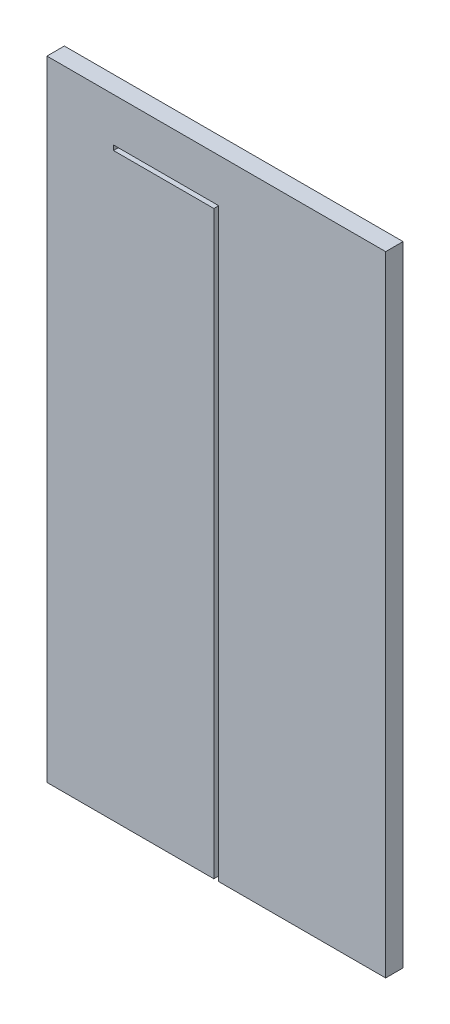
ISO-10303-21;
HEADER;
FILE_DESCRIPTION(('STEP AP214'),'2;1');
FILE_NAME('part.step','',(''),(''),'','','');
FILE_SCHEMA(('AUTOMOTIVE_DESIGN { 1 0 10303 214 1 1 1 1 }'));
ENDSEC;
DATA;
#1=APPLICATION_CONTEXT('core data for automotive mechanical design processes');
#2=APPLICATION_PROTOCOL_DEFINITION('international standard','automotive_design',2000,#1);
#3=PRODUCT_CONTEXT('',#1,'mechanical');
#4=PRODUCT('Part','Part','',(#3));
#5=PRODUCT_RELATED_PRODUCT_CATEGORY('part','',(#4));
#6=PRODUCT_DEFINITION_FORMATION('','',#4);
#7=PRODUCT_DEFINITION_CONTEXT('part definition',#1,'design');
#8=PRODUCT_DEFINITION('design','',#6,#7);
#9=PRODUCT_DEFINITION_SHAPE('','',#8);
#10=(LENGTH_UNIT() NAMED_UNIT(*) SI_UNIT(.MILLI.,.METRE.));
#11=(NAMED_UNIT(*) PLANE_ANGLE_UNIT() SI_UNIT($,.RADIAN.));
#12=(NAMED_UNIT(*) SI_UNIT($,.STERADIAN.) SOLID_ANGLE_UNIT());
#13=UNCERTAINTY_MEASURE_WITH_UNIT(LENGTH_MEASURE(1.E-05),#10,'distance_accuracy_value','');
#14=(GEOMETRIC_REPRESENTATION_CONTEXT(3) GLOBAL_UNCERTAINTY_ASSIGNED_CONTEXT((#13)) GLOBAL_UNIT_ASSIGNED_CONTEXT((#10,
#11,#12)) REPRESENTATION_CONTEXT('',''));
#15=CARTESIAN_POINT('',(0.,0.,0.));
#16=DIRECTION('',(0.,0.,1.));
#17=DIRECTION('',(1.,0.,0.));
#18=AXIS2_PLACEMENT_3D('',#15,#16,#17);
#19=CARTESIAN_POINT('',(0.,0.,18.));
#20=DIRECTION('',(0.,1.,0.));
#21=DIRECTION('',(0.,0.,1.));
#22=AXIS2_PLACEMENT_3D('',#19,#20,#21);
#23=PLANE('',#22);
#24=DIRECTION('',(0.,0.,1.));
#25=VECTOR('',#24,1.);
#26=CARTESIAN_POINT('',(172.5,0.,8.));
#27=LINE('',#26,#25);
#28=CARTESIAN_POINT('',(172.5,0.,8.));
#29=VERTEX_POINT('',#28);
#30=CARTESIAN_POINT('',(172.5,0.,18.));
#31=VERTEX_POINT('',#30);
#32=EDGE_CURVE('E310',#29,#31,#27,.T.);
#33=ORIENTED_EDGE('',*,*,#32,.T.);
#34=DIRECTION('',(1.,0.,0.));
#35=VECTOR('',#34,1.);
#36=CARTESIAN_POINT('',(0.,0.,18.));
#37=LINE('',#36,#35);
#38=CARTESIAN_POINT('',(0.,0.,18.));
#39=VERTEX_POINT('',#38);
#40=EDGE_CURVE('E87',#39,#31,#37,.T.);
#41=ORIENTED_EDGE('',*,*,#40,.F.);
#42=DIRECTION('',(0.,0.,-1.));
#43=VECTOR('',#42,1.);
#44=CARTESIAN_POINT('',(0.,0.,18.));
#45=LINE('',#44,#43);
#46=CARTESIAN_POINT('',(0.,0.,0.));
#47=VERTEX_POINT('',#46);
#48=EDGE_CURVE('E11',#39,#47,#45,.T.);
#49=ORIENTED_EDGE('',*,*,#48,.T.);
#50=DIRECTION('',(1.,0.,0.));
#51=VECTOR('',#50,1.);
#52=CARTESIAN_POINT('',(0.,0.,0.));
#53=LINE('',#52,#51);
#54=CARTESIAN_POINT('',(350.,0.,0.));
#55=VERTEX_POINT('',#54);
#56=EDGE_CURVE('E271',#47,#55,#53,.T.);
#57=ORIENTED_EDGE('',*,*,#56,.T.);
#58=DIRECTION('',(0.,0.,-1.));
#59=VECTOR('',#58,1.);
#60=CARTESIAN_POINT('',(350.,0.,18.));
#61=LINE('',#60,#59);
#62=CARTESIAN_POINT('',(350.,0.,18.));
#63=VERTEX_POINT('',#62);
#64=EDGE_CURVE('E43',#63,#55,#61,.T.);
#65=ORIENTED_EDGE('',*,*,#64,.F.);
#66=CARTESIAN_POINT('',(177.5,0.,18.));
#67=VERTEX_POINT('',#66);
#68=EDGE_CURVE('E262',#67,#63,#37,.T.);
#69=ORIENTED_EDGE('',*,*,#68,.F.);
#70=DIRECTION('',(0.,0.,-1.));
#71=VECTOR('',#70,1.);
#72=CARTESIAN_POINT('',(177.5,0.,8.));
#73=LINE('',#72,#71);
#74=CARTESIAN_POINT('',(177.5,0.,8.));
#75=VERTEX_POINT('',#74);
#76=EDGE_CURVE('E50',#67,#75,#73,.T.);
#77=ORIENTED_EDGE('',*,*,#76,.T.);
#78=DIRECTION('',(1.,0.,0.));
#79=VECTOR('',#78,1.);
#80=CARTESIAN_POINT('',(190.,0.,8.));
#81=LINE('',#80,#79);
#82=CARTESIAN_POINT('',(190.,0.,8.));
#83=VERTEX_POINT('',#82);
#84=EDGE_CURVE('E336',#75,#83,#81,.T.);
#85=ORIENTED_EDGE('',*,*,#84,.T.);
#86=DIRECTION('',(0.,0.,-1.));
#87=VECTOR('',#86,1.);
#88=CARTESIAN_POINT('',(190.,0.,3.));
#89=LINE('',#88,#87);
#90=CARTESIAN_POINT('',(190.,0.,3.));
#91=VERTEX_POINT('',#90);
#92=EDGE_CURVE('E272',#83,#91,#89,.T.);
#93=ORIENTED_EDGE('',*,*,#92,.T.);
#94=DIRECTION('',(-1.,0.,0.));
#95=VECTOR('',#94,1.);
#96=CARTESIAN_POINT('',(190.,0.,3.));
#97=LINE('',#96,#95);
#98=CARTESIAN_POINT('',(160.,0.,3.));
#99=VERTEX_POINT('',#98);
#100=EDGE_CURVE('E165',#91,#99,#97,.T.);
#101=ORIENTED_EDGE('',*,*,#100,.T.);
#102=DIRECTION('',(0.,0.,1.));
#103=VECTOR('',#102,1.);
#104=CARTESIAN_POINT('',(160.,0.,3.));
#105=LINE('',#104,#103);
#106=CARTESIAN_POINT('',(160.,0.,8.));
#107=VERTEX_POINT('',#106);
#108=EDGE_CURVE('E198',#99,#107,#105,.T.);
#109=ORIENTED_EDGE('',*,*,#108,.T.);
#110=DIRECTION('',(1.,0.,0.));
#111=VECTOR('',#110,1.);
#112=CARTESIAN_POINT('',(160.,0.,8.));
#113=LINE('',#112,#111);
#114=EDGE_CURVE('E312',#107,#29,#113,.T.);
#115=ORIENTED_EDGE('',*,*,#114,.T.);
#116=EDGE_LOOP('',(#33,#41,#49,#57,#65,#69,#77,#85,#93,#101,#109,#115));
#117=FACE_BOUND('',#116,.T.);
#118=ADVANCED_FACE('F35',(#117),#23,.F.);
#119=CARTESIAN_POINT('',(0.,0.,18.));
#120=DIRECTION('',(0.,0.,-1.));
#121=DIRECTION('',(-1.,0.,0.));
#122=AXIS2_PLACEMENT_3D('',#119,#120,#121);
#123=PLANE('',#122);
#124=DIRECTION('',(0.,1.,0.));
#125=VECTOR('',#124,1.);
#126=CARTESIAN_POINT('',(172.5,-6.02357194163659,18.));
#127=LINE('',#126,#125);
#128=CARTESIAN_POINT('',(172.5,599.857194163659,18.));
#129=VERTEX_POINT('',#128);
#130=EDGE_CURVE('E222',#31,#129,#127,.T.);
#131=ORIENTED_EDGE('',*,*,#130,.T.);
#132=DIRECTION('',(-1.,0.,0.));
#133=VECTOR('',#132,1.);
#134=CARTESIAN_POINT('',(191.6,599.857194163659,18.));
#135=LINE('',#134,#133);
#136=CARTESIAN_POINT('',(68.7877037308197,599.857194163659,18.));
#137=VERTEX_POINT('',#136);
#138=EDGE_CURVE('E249',#129,#137,#135,.T.);
#139=ORIENTED_EDGE('',*,*,#138,.T.);
#140=DIRECTION('',(0.,-1.,0.));
#141=VECTOR('',#140,1.);
#142=CARTESIAN_POINT('',(68.7877037308197,599.857194163659,18.));
#143=LINE('',#142,#141);
#144=CARTESIAN_POINT('',(68.7877037308197,604.857194163659,18.));
#145=VERTEX_POINT('',#144);
#146=EDGE_CURVE('E234',#145,#137,#143,.T.);
#147=ORIENTED_EDGE('',*,*,#146,.F.);
#148=DIRECTION('',(-1.,0.,0.));
#149=VECTOR('',#148,1.);
#150=CARTESIAN_POINT('',(191.6,604.857194163659,18.));
#151=LINE('',#150,#149);
#152=CARTESIAN_POINT('',(177.5,604.857194163659,18.));
#153=VERTEX_POINT('',#152);
#154=EDGE_CURVE('E252',#153,#145,#151,.T.);
#155=ORIENTED_EDGE('',*,*,#154,.F.);
#156=DIRECTION('',(0.,1.,0.));
#157=VECTOR('',#156,1.);
#158=CARTESIAN_POINT('',(177.5,-6.02357194163659,18.));
#159=LINE('',#158,#157);
#160=EDGE_CURVE('E220',#67,#153,#159,.T.);
#161=ORIENTED_EDGE('',*,*,#160,.F.);
#162=ORIENTED_EDGE('',*,*,#68,.T.);
#163=DIRECTION('',(0.,1.,0.));
#164=VECTOR('',#163,1.);
#165=CARTESIAN_POINT('',(350.,0.,18.));
#166=LINE('',#165,#164);
#167=CARTESIAN_POINT('',(350.,650.,18.));
#168=VERTEX_POINT('',#167);
#169=EDGE_CURVE('E264',#63,#168,#166,.T.);
#170=ORIENTED_EDGE('',*,*,#169,.T.);
#171=DIRECTION('',(-1.,0.,0.));
#172=VECTOR('',#171,1.);
#173=CARTESIAN_POINT('',(0.,650.,18.));
#174=LINE('',#173,#172);
#175=CARTESIAN_POINT('',(0.,650.,18.));
#176=VERTEX_POINT('',#175);
#177=EDGE_CURVE('E59',#168,#176,#174,.T.);
#178=ORIENTED_EDGE('',*,*,#177,.T.);
#179=DIRECTION('',(0.,-1.,0.));
#180=VECTOR('',#179,1.);
#181=CARTESIAN_POINT('',(0.,0.,18.));
#182=LINE('',#181,#180);
#183=EDGE_CURVE('E260',#176,#39,#182,.T.);
#184=ORIENTED_EDGE('',*,*,#183,.T.);
#185=ORIENTED_EDGE('',*,*,#40,.T.);
#186=EDGE_LOOP('',(#131,#139,#147,#155,#161,#162,#170,#178,#184,#185));
#187=FACE_BOUND('',#186,.T.);
#188=ADVANCED_FACE('F304',(#187),#123,.F.);
#189=CARTESIAN_POINT('',(0.,0.,18.));
#190=DIRECTION('',(1.,0.,0.));
#191=DIRECTION('',(0.,0.,-1.));
#192=AXIS2_PLACEMENT_3D('',#189,#190,#191);
#193=PLANE('',#192);
#194=DIRECTION('',(0.,-1.,0.));
#195=VECTOR('',#194,1.);
#196=CARTESIAN_POINT('',(0.,0.,0.));
#197=LINE('',#196,#195);
#198=CARTESIAN_POINT('',(0.,650.,0.));
#199=VERTEX_POINT('',#198);
#200=EDGE_CURVE('E268',#199,#47,#197,.T.);
#201=ORIENTED_EDGE('',*,*,#200,.T.);
#202=ORIENTED_EDGE('',*,*,#48,.F.);
#203=ORIENTED_EDGE('',*,*,#183,.F.);
#204=DIRECTION('',(0.,0.,-1.));
#205=VECTOR('',#204,1.);
#206=CARTESIAN_POINT('',(0.,650.,18.));
#207=LINE('',#206,#205);
#208=EDGE_CURVE('E267',#176,#199,#207,.T.);
#209=ORIENTED_EDGE('',*,*,#208,.T.);
#210=EDGE_LOOP('',(#201,#202,#203,#209));
#211=FACE_BOUND('',#210,.T.);
#212=ADVANCED_FACE('F37',(#211),#193,.F.);
#213=CARTESIAN_POINT('',(350.,0.,18.));
#214=DIRECTION('',(-1.,0.,0.));
#215=DIRECTION('',(0.,0.,1.));
#216=AXIS2_PLACEMENT_3D('',#213,#214,#215);
#217=PLANE('',#216);
#218=DIRECTION('',(0.,1.,0.));
#219=VECTOR('',#218,1.);
#220=CARTESIAN_POINT('',(350.,0.,0.));
#221=LINE('',#220,#219);
#222=CARTESIAN_POINT('',(350.,650.,0.));
#223=VERTEX_POINT('',#222);
#224=EDGE_CURVE('E274',#55,#223,#221,.T.);
#225=ORIENTED_EDGE('',*,*,#224,.T.);
#226=DIRECTION('',(0.,0.,-1.));
#227=VECTOR('',#226,1.);
#228=CARTESIAN_POINT('',(350.,650.,18.));
#229=LINE('',#228,#227);
#230=EDGE_CURVE('E278',#168,#223,#229,.T.);
#231=ORIENTED_EDGE('',*,*,#230,.F.);
#232=ORIENTED_EDGE('',*,*,#169,.F.);
#233=ORIENTED_EDGE('',*,*,#64,.T.);
#234=EDGE_LOOP('',(#225,#231,#232,#233));
#235=FACE_BOUND('',#234,.T.);
#236=ADVANCED_FACE('F284',(#235),#217,.F.);
#237=CARTESIAN_POINT('',(0.,650.,18.));
#238=DIRECTION('',(0.,-1.,0.));
#239=DIRECTION('',(0.,0.,-1.));
#240=AXIS2_PLACEMENT_3D('',#237,#238,#239);
#241=PLANE('',#240);
#242=DIRECTION('',(-1.,0.,0.));
#243=VECTOR('',#242,1.);
#244=CARTESIAN_POINT('',(0.,650.,0.));
#245=LINE('',#244,#243);
#246=EDGE_CURVE('E80',#223,#199,#245,.T.);
#247=ORIENTED_EDGE('',*,*,#246,.T.);
#248=ORIENTED_EDGE('',*,*,#208,.F.);
#249=ORIENTED_EDGE('',*,*,#177,.F.);
#250=ORIENTED_EDGE('',*,*,#230,.T.);
#251=EDGE_LOOP('',(#247,#248,#249,#250));
#252=FACE_BOUND('',#251,.T.);
#253=ADVANCED_FACE('F293',(#252),#241,.F.);
#254=CARTESIAN_POINT('',(0.,0.,0.));
#255=DIRECTION('',(0.,0.,-1.));
#256=DIRECTION('',(-1.,0.,0.));
#257=AXIS2_PLACEMENT_3D('',#254,#255,#256);
#258=PLANE('',#257);
#259=ORIENTED_EDGE('',*,*,#200,.F.);
#260=ORIENTED_EDGE('',*,*,#246,.F.);
#261=ORIENTED_EDGE('',*,*,#224,.F.);
#262=ORIENTED_EDGE('',*,*,#56,.F.);
#263=EDGE_LOOP('',(#259,#260,#261,#262));
#264=FACE_BOUND('',#263,.T.);
#265=ADVANCED_FACE('F289',(#264),#258,.T.);
#266=CARTESIAN_POINT('',(68.7877037308197,427.357194163659,0.));
#267=DIRECTION('',(1.,0.,0.));
#268=DIRECTION('',(0.,0.,-1.));
#269=AXIS2_PLACEMENT_3D('',#266,#267,#268);
#270=PLANE('',#269);
#271=DIRECTION('',(0.,-1.,0.));
#272=VECTOR('',#271,1.);
#273=CARTESIAN_POINT('',(68.7877037308197,587.357194163659,8.));
#274=LINE('',#273,#272);
#275=CARTESIAN_POINT('',(68.7877037308197,599.857194163659,8.));
#276=VERTEX_POINT('',#275);
#277=CARTESIAN_POINT('',(68.7877037308197,587.357194163659,8.));
#278=VERTEX_POINT('',#277);
#279=EDGE_CURVE('E230',#276,#278,#274,.T.);
#280=ORIENTED_EDGE('',*,*,#279,.T.);
#281=DIRECTION('',(0.,0.,-1.));
#282=VECTOR('',#281,1.);
#283=CARTESIAN_POINT('',(68.7877037308197,587.357194163659,3.));
#284=LINE('',#283,#282);
#285=CARTESIAN_POINT('',(68.7877037308197,587.357194163659,3.));
#286=VERTEX_POINT('',#285);
#287=EDGE_CURVE('E228',#278,#286,#284,.T.);
#288=ORIENTED_EDGE('',*,*,#287,.T.);
#289=DIRECTION('',(0.,1.,0.));
#290=VECTOR('',#289,1.);
#291=CARTESIAN_POINT('',(68.7877037308197,617.357194163659,3.));
#292=LINE('',#291,#290);
#293=CARTESIAN_POINT('',(68.7877037308197,617.357194163659,3.));
#294=VERTEX_POINT('',#293);
#295=EDGE_CURVE('E241',#286,#294,#292,.T.);
#296=ORIENTED_EDGE('',*,*,#295,.T.);
#297=DIRECTION('',(0.,0.,1.));
#298=VECTOR('',#297,1.);
#299=CARTESIAN_POINT('',(68.7877037308197,617.357194163659,3.));
#300=LINE('',#299,#298);
#301=CARTESIAN_POINT('',(68.7877037308197,617.357194163659,8.));
#302=VERTEX_POINT('',#301);
#303=EDGE_CURVE('E191',#294,#302,#300,.T.);
#304=ORIENTED_EDGE('',*,*,#303,.T.);
#305=DIRECTION('',(0.,-1.,0.));
#306=VECTOR('',#305,1.);
#307=CARTESIAN_POINT('',(68.7877037308197,617.357194163659,8.));
#308=LINE('',#307,#306);
#309=CARTESIAN_POINT('',(68.7877037308197,604.857194163659,8.));
#310=VERTEX_POINT('',#309);
#311=EDGE_CURVE('E238',#302,#310,#308,.T.);
#312=ORIENTED_EDGE('',*,*,#311,.T.);
#313=DIRECTION('',(0.,0.,1.));
#314=VECTOR('',#313,1.);
#315=CARTESIAN_POINT('',(68.7877037308197,604.857194163659,8.));
#316=LINE('',#315,#314);
#317=EDGE_CURVE('E236',#310,#145,#316,.T.);
#318=ORIENTED_EDGE('',*,*,#317,.T.);
#319=ORIENTED_EDGE('',*,*,#146,.T.);
#320=DIRECTION('',(0.,0.,-1.));
#321=VECTOR('',#320,1.);
#322=CARTESIAN_POINT('',(68.7877037308197,599.857194163659,8.));
#323=LINE('',#322,#321);
#324=EDGE_CURVE('E232',#137,#276,#323,.T.);
#325=ORIENTED_EDGE('',*,*,#324,.T.);
#326=EDGE_LOOP('',(#280,#288,#296,#304,#312,#318,#319,#325));
#327=FACE_BOUND('',#326,.T.);
#328=ADVANCED_FACE('F300',(#327),#270,.T.);
#329=CARTESIAN_POINT('',(191.6,617.357194163659,3.));
#330=DIRECTION('',(0.,0.,1.));
#331=DIRECTION('',(1.,0.,0.));
#332=AXIS2_PLACEMENT_3D('',#329,#330,#331);
#333=PLANE('',#332);
#334=DIRECTION('',(-0.707106781186548,-0.707106781186548,0.));
#335=VECTOR('',#334,1.);
#336=CARTESIAN_POINT('',(-121.690383052648,305.666811111011,3.));
#337=LINE('',#336,#335);
#338=CARTESIAN_POINT('',(190.,617.357194163659,3.));
#339=VERTEX_POINT('',#338);
#340=CARTESIAN_POINT('',(160.,587.357194163659,3.));
#341=VERTEX_POINT('',#340);
#342=EDGE_CURVE('E163',#339,#341,#337,.T.);
#343=ORIENTED_EDGE('',*,*,#342,.F.);
#344=DIRECTION('',(-1.,0.,0.));
#345=VECTOR('',#344,1.);
#346=CARTESIAN_POINT('',(191.6,617.357194163659,3.));
#347=LINE('',#346,#345);
#348=EDGE_CURVE('E178',#339,#294,#347,.T.);
#349=ORIENTED_EDGE('',*,*,#348,.T.);
#350=ORIENTED_EDGE('',*,*,#295,.F.);
#351=DIRECTION('',(-1.,0.,0.));
#352=VECTOR('',#351,1.);
#353=CARTESIAN_POINT('',(191.6,587.357194163659,3.));
#354=LINE('',#353,#352);
#355=EDGE_CURVE('E180',#341,#286,#354,.T.);
#356=ORIENTED_EDGE('',*,*,#355,.F.);
#357=EDGE_LOOP('',(#343,#349,#350,#356));
#358=FACE_BOUND('',#357,.T.);
#359=ADVANCED_FACE('F176',(#358),#333,.T.);
#360=CARTESIAN_POINT('',(191.6,617.357194163659,3.));
#361=DIRECTION('',(0.,-1.,0.));
#362=DIRECTION('',(0.,0.,-1.));
#363=AXIS2_PLACEMENT_3D('',#360,#361,#362);
#364=PLANE('',#363);
#365=DIRECTION('',(0.,0.,-1.));
#366=VECTOR('',#365,1.);
#367=CARTESIAN_POINT('',(190.,617.357194163659,3.));
#368=LINE('',#367,#366);
#369=CARTESIAN_POINT('',(190.,617.357194163659,8.));
#370=VERTEX_POINT('',#369);
#371=EDGE_CURVE('E189',#370,#339,#368,.T.);
#372=ORIENTED_EDGE('',*,*,#371,.F.);
#373=DIRECTION('',(-1.,0.,0.));
#374=VECTOR('',#373,1.);
#375=CARTESIAN_POINT('',(191.6,617.357194163659,8.));
#376=LINE('',#375,#374);
#377=EDGE_CURVE('E192',#370,#302,#376,.T.);
#378=ORIENTED_EDGE('',*,*,#377,.T.);
#379=ORIENTED_EDGE('',*,*,#303,.F.);
#380=ORIENTED_EDGE('',*,*,#348,.F.);
#381=EDGE_LOOP('',(#372,#378,#379,#380));
#382=FACE_BOUND('',#381,.T.);
#383=ADVANCED_FACE('F187',(#382),#364,.T.);
#384=CARTESIAN_POINT('',(191.6,617.357194163659,8.));
#385=DIRECTION('',(0.,0.,-1.));
#386=DIRECTION('',(-1.,0.,0.));
#387=AXIS2_PLACEMENT_3D('',#384,#385,#386);
#388=PLANE('',#387);
#389=DIRECTION('',(0.707106781186548,0.707106781186548,0.));
#390=VECTOR('',#389,1.);
#391=CARTESIAN_POINT('',(-121.690383052648,305.666811111011,8.));
#392=LINE('',#391,#390);
#393=CARTESIAN_POINT('',(177.5,604.857194163659,8.));
#394=VERTEX_POINT('',#393);
#395=EDGE_CURVE('E196',#394,#370,#392,.T.);
#396=ORIENTED_EDGE('',*,*,#395,.F.);
#397=DIRECTION('',(-1.,0.,0.));
#398=VECTOR('',#397,1.);
#399=CARTESIAN_POINT('',(191.6,604.857194163659,8.));
#400=LINE('',#399,#398);
#401=EDGE_CURVE('E255',#394,#310,#400,.T.);
#402=ORIENTED_EDGE('',*,*,#401,.T.);
#403=ORIENTED_EDGE('',*,*,#311,.F.);
#404=ORIENTED_EDGE('',*,*,#377,.F.);
#405=EDGE_LOOP('',(#396,#402,#403,#404));
#406=FACE_BOUND('',#405,.T.);
#407=ADVANCED_FACE('F344',(#406),#388,.T.);
#408=CARTESIAN_POINT('',(191.6,604.857194163659,8.));
#409=DIRECTION('',(0.,-1.,0.));
#410=DIRECTION('',(0.,0.,-1.));
#411=AXIS2_PLACEMENT_3D('',#408,#409,#410);
#412=PLANE('',#411);
#413=DIRECTION('',(0.,0.,-1.));
#414=VECTOR('',#413,1.);
#415=CARTESIAN_POINT('',(177.5,604.857194163659,8.));
#416=LINE('',#415,#414);
#417=EDGE_CURVE('E201',#153,#394,#416,.T.);
#418=ORIENTED_EDGE('',*,*,#417,.F.);
#419=ORIENTED_EDGE('',*,*,#154,.T.);
#420=ORIENTED_EDGE('',*,*,#317,.F.);
#421=ORIENTED_EDGE('',*,*,#401,.F.);
#422=EDGE_LOOP('',(#418,#419,#420,#421));
#423=FACE_BOUND('',#422,.T.);
#424=ADVANCED_FACE('F349',(#423),#412,.T.);
#425=CARTESIAN_POINT('',(191.6,599.857194163659,8.));
#426=DIRECTION('',(0.,1.,0.));
#427=DIRECTION('',(0.,0.,1.));
#428=AXIS2_PLACEMENT_3D('',#425,#426,#427);
#429=PLANE('',#428);
#430=DIRECTION('',(0.,0.,1.));
#431=VECTOR('',#430,1.);
#432=CARTESIAN_POINT('',(172.5,599.857194163659,8.));
#433=LINE('',#432,#431);
#434=CARTESIAN_POINT('',(172.5,599.857194163659,8.));
#435=VERTEX_POINT('',#434);
#436=EDGE_CURVE('E208',#435,#129,#433,.T.);
#437=ORIENTED_EDGE('',*,*,#436,.F.);
#438=DIRECTION('',(-1.,0.,0.));
#439=VECTOR('',#438,1.);
#440=CARTESIAN_POINT('',(191.6,599.857194163659,8.));
#441=LINE('',#440,#439);
#442=EDGE_CURVE('E246',#435,#276,#441,.T.);
#443=ORIENTED_EDGE('',*,*,#442,.T.);
#444=ORIENTED_EDGE('',*,*,#324,.F.);
#445=ORIENTED_EDGE('',*,*,#138,.F.);
#446=EDGE_LOOP('',(#437,#443,#444,#445));
#447=FACE_BOUND('',#446,.T.);
#448=ADVANCED_FACE('F321',(#447),#429,.T.);
#449=CARTESIAN_POINT('',(191.6,587.357194163659,8.));
#450=DIRECTION('',(0.,0.,-1.));
#451=DIRECTION('',(-1.,0.,0.));
#452=AXIS2_PLACEMENT_3D('',#449,#450,#451);
#453=PLANE('',#452);
#454=DIRECTION('',(0.707106781186548,0.707106781186548,0.));
#455=VECTOR('',#454,1.);
#456=CARTESIAN_POINT('',(-136.690383052648,290.666811111011,8.));
#457=LINE('',#456,#455);
#458=CARTESIAN_POINT('',(160.,587.357194163659,8.));
#459=VERTEX_POINT('',#458);
#460=EDGE_CURVE('E211',#459,#435,#457,.T.);
#461=ORIENTED_EDGE('',*,*,#460,.F.);
#462=DIRECTION('',(-1.,0.,0.));
#463=VECTOR('',#462,1.);
#464=CARTESIAN_POINT('',(191.6,587.357194163659,8.));
#465=LINE('',#464,#463);
#466=EDGE_CURVE('E243',#459,#278,#465,.T.);
#467=ORIENTED_EDGE('',*,*,#466,.T.);
#468=ORIENTED_EDGE('',*,*,#279,.F.);
#469=ORIENTED_EDGE('',*,*,#442,.F.);
#470=EDGE_LOOP('',(#461,#467,#468,#469));
#471=FACE_BOUND('',#470,.T.);
#472=ADVANCED_FACE('F326',(#471),#453,.T.);
#473=CARTESIAN_POINT('',(191.6,587.357194163659,3.));
#474=DIRECTION('',(0.,1.,0.));
#475=DIRECTION('',(0.,0.,1.));
#476=AXIS2_PLACEMENT_3D('',#473,#474,#475);
#477=PLANE('',#476);
#478=DIRECTION('',(0.,0.,1.));
#479=VECTOR('',#478,1.);
#480=CARTESIAN_POINT('',(160.,587.357194163659,3.));
#481=LINE('',#480,#479);
#482=EDGE_CURVE('E181',#341,#459,#481,.T.);
#483=ORIENTED_EDGE('',*,*,#482,.F.);
#484=ORIENTED_EDGE('',*,*,#355,.T.);
#485=ORIENTED_EDGE('',*,*,#287,.F.);
#486=ORIENTED_EDGE('',*,*,#466,.F.);
#487=EDGE_LOOP('',(#483,#484,#485,#486));
#488=FACE_BOUND('',#487,.T.);
#489=ADVANCED_FACE('F355',(#488),#477,.T.);
#490=CARTESIAN_POINT('',(160.,-6.02357194163659,3.));
#491=DIRECTION('',(1.,0.,0.));
#492=DIRECTION('',(0.,0.,-1.));
#493=AXIS2_PLACEMENT_3D('',#490,#491,#492);
#494=PLANE('',#493);
#495=DIRECTION('',(0.,1.,0.));
#496=VECTOR('',#495,1.);
#497=CARTESIAN_POINT('',(160.,-6.02357194163659,3.));
#498=LINE('',#497,#496);
#499=EDGE_CURVE('E170',#99,#341,#498,.T.);
#500=ORIENTED_EDGE('',*,*,#499,.T.);
#501=ORIENTED_EDGE('',*,*,#482,.T.);
#502=DIRECTION('',(0.,1.,0.));
#503=VECTOR('',#502,1.);
#504=CARTESIAN_POINT('',(160.,-6.02357194163659,8.));
#505=LINE('',#504,#503);
#506=EDGE_CURVE('E182',#107,#459,#505,.T.);
#507=ORIENTED_EDGE('',*,*,#506,.F.);
#508=ORIENTED_EDGE('',*,*,#108,.F.);
#509=EDGE_LOOP('',(#500,#501,#507,#508));
#510=FACE_BOUND('',#509,.T.);
#511=ADVANCED_FACE('F332',(#510),#494,.T.);
#512=CARTESIAN_POINT('',(160.,-6.02357194163659,8.));
#513=DIRECTION('',(0.,0.,-1.));
#514=DIRECTION('',(-1.,0.,0.));
#515=AXIS2_PLACEMENT_3D('',#512,#513,#514);
#516=PLANE('',#515);
#517=ORIENTED_EDGE('',*,*,#506,.T.);
#518=ORIENTED_EDGE('',*,*,#460,.T.);
#519=DIRECTION('',(0.,1.,0.));
#520=VECTOR('',#519,1.);
#521=CARTESIAN_POINT('',(172.5,-6.02357194163659,8.));
#522=LINE('',#521,#520);
#523=EDGE_CURVE('E225',#29,#435,#522,.T.);
#524=ORIENTED_EDGE('',*,*,#523,.F.);
#525=ORIENTED_EDGE('',*,*,#114,.F.);
#526=EDGE_LOOP('',(#517,#518,#524,#525));
#527=FACE_BOUND('',#526,.T.);
#528=ADVANCED_FACE('F329',(#527),#516,.T.);
#529=CARTESIAN_POINT('',(172.5,-6.02357194163659,8.));
#530=DIRECTION('',(1.,0.,0.));
#531=DIRECTION('',(0.,0.,-1.));
#532=AXIS2_PLACEMENT_3D('',#529,#530,#531);
#533=PLANE('',#532);
#534=ORIENTED_EDGE('',*,*,#523,.T.);
#535=ORIENTED_EDGE('',*,*,#436,.T.);
#536=ORIENTED_EDGE('',*,*,#130,.F.);
#537=ORIENTED_EDGE('',*,*,#32,.F.);
#538=EDGE_LOOP('',(#534,#535,#536,#537));
#539=FACE_BOUND('',#538,.T.);
#540=ADVANCED_FACE('F317',(#539),#533,.T.);
#541=CARTESIAN_POINT('',(177.5,-6.02357194163659,8.));
#542=DIRECTION('',(-1.,0.,0.));
#543=DIRECTION('',(0.,0.,1.));
#544=AXIS2_PLACEMENT_3D('',#541,#542,#543);
#545=PLANE('',#544);
#546=ORIENTED_EDGE('',*,*,#160,.T.);
#547=ORIENTED_EDGE('',*,*,#417,.T.);
#548=DIRECTION('',(0.,1.,0.));
#549=VECTOR('',#548,1.);
#550=CARTESIAN_POINT('',(177.5,-6.02357194163659,8.));
#551=LINE('',#550,#549);
#552=EDGE_CURVE('E218',#75,#394,#551,.T.);
#553=ORIENTED_EDGE('',*,*,#552,.F.);
#554=ORIENTED_EDGE('',*,*,#76,.F.);
#555=EDGE_LOOP('',(#546,#547,#553,#554));
#556=FACE_BOUND('',#555,.T.);
#557=ADVANCED_FACE('F351',(#556),#545,.T.);
#558=CARTESIAN_POINT('',(190.,-6.02357194163659,8.));
#559=DIRECTION('',(0.,0.,-1.));
#560=DIRECTION('',(-1.,0.,0.));
#561=AXIS2_PLACEMENT_3D('',#558,#559,#560);
#562=PLANE('',#561);
#563=ORIENTED_EDGE('',*,*,#552,.T.);
#564=ORIENTED_EDGE('',*,*,#395,.T.);
#565=DIRECTION('',(0.,1.,0.));
#566=VECTOR('',#565,1.);
#567=CARTESIAN_POINT('',(190.,-6.02357194163659,8.));
#568=LINE('',#567,#566);
#569=EDGE_CURVE('E169',#83,#370,#568,.T.);
#570=ORIENTED_EDGE('',*,*,#569,.F.);
#571=ORIENTED_EDGE('',*,*,#84,.F.);
#572=EDGE_LOOP('',(#563,#564,#570,#571));
#573=FACE_BOUND('',#572,.T.);
#574=ADVANCED_FACE('F340',(#573),#562,.T.);
#575=CARTESIAN_POINT('',(190.,-6.02357194163659,3.));
#576=DIRECTION('',(-1.,0.,0.));
#577=DIRECTION('',(0.,0.,1.));
#578=AXIS2_PLACEMENT_3D('',#575,#576,#577);
#579=PLANE('',#578);
#580=ORIENTED_EDGE('',*,*,#569,.T.);
#581=ORIENTED_EDGE('',*,*,#371,.T.);
#582=DIRECTION('',(0.,1.,0.));
#583=VECTOR('',#582,1.);
#584=CARTESIAN_POINT('',(190.,-6.02357194163659,3.));
#585=LINE('',#584,#583);
#586=EDGE_CURVE('E159',#91,#339,#585,.T.);
#587=ORIENTED_EDGE('',*,*,#586,.F.);
#588=ORIENTED_EDGE('',*,*,#92,.F.);
#589=EDGE_LOOP('',(#580,#581,#587,#588));
#590=FACE_BOUND('',#589,.T.);
#591=ADVANCED_FACE('F194',(#590),#579,.T.);
#592=CARTESIAN_POINT('',(190.,-6.02357194163659,3.));
#593=DIRECTION('',(0.,0.,1.));
#594=DIRECTION('',(1.,0.,0.));
#595=AXIS2_PLACEMENT_3D('',#592,#593,#594);
#596=PLANE('',#595);
#597=ORIENTED_EDGE('',*,*,#586,.T.);
#598=ORIENTED_EDGE('',*,*,#342,.T.);
#599=ORIENTED_EDGE('',*,*,#499,.F.);
#600=ORIENTED_EDGE('',*,*,#100,.F.);
#601=EDGE_LOOP('',(#597,#598,#599,#600));
#602=FACE_BOUND('',#601,.T.);
#603=ADVANCED_FACE('F161',(#602),#596,.T.);
#604=CLOSED_SHELL('',(#118,#188,#212,#236,#253,#265,#328,#359,#383,#407,#424,#448,#472,#489,
#511,#528,#540,#557,#574,#591,#603));
#605=MANIFOLD_SOLID_BREP('B2',#604);
#606=ADVANCED_BREP_SHAPE_REPRESENTATION('',(#18,#605),#14);
#607=SHAPE_DEFINITION_REPRESENTATION(#9,#606);
ENDSEC;
END-ISO-10303-21;
